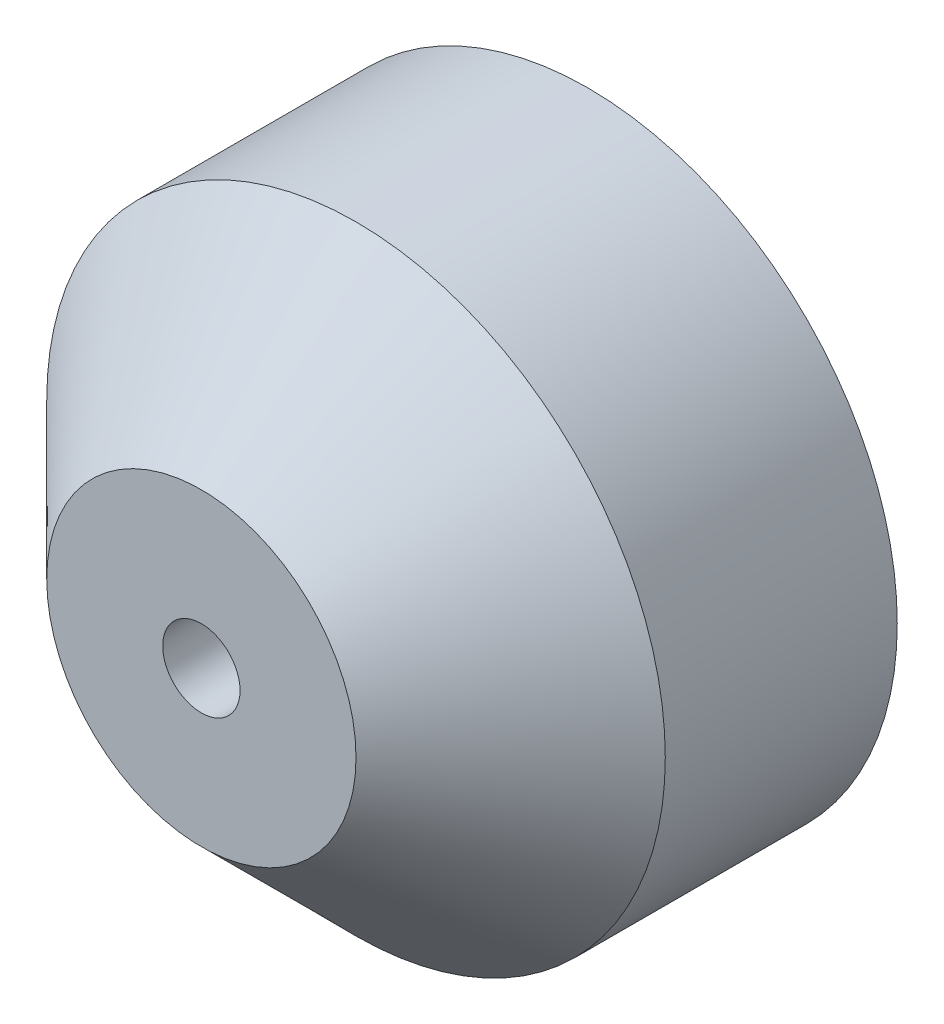
ISO-10303-21;
HEADER;
FILE_DESCRIPTION(('STEP AP214'),'2;1');
FILE_NAME('part.step','',(''),(''),'','','');
FILE_SCHEMA(('AUTOMOTIVE_DESIGN { 1 0 10303 214 1 1 1 1 }'));
ENDSEC;
DATA;
#1=APPLICATION_CONTEXT('core data for automotive mechanical design processes');
#2=APPLICATION_PROTOCOL_DEFINITION('international standard','automotive_design',2000,#1);
#3=PRODUCT_CONTEXT('',#1,'mechanical');
#4=PRODUCT('Part','Part','',(#3));
#5=PRODUCT_RELATED_PRODUCT_CATEGORY('part','',(#4));
#6=PRODUCT_DEFINITION_FORMATION('','',#4);
#7=PRODUCT_DEFINITION_CONTEXT('part definition',#1,'design');
#8=PRODUCT_DEFINITION('design','',#6,#7);
#9=PRODUCT_DEFINITION_SHAPE('','',#8);
#10=(LENGTH_UNIT() NAMED_UNIT(*) SI_UNIT(.MILLI.,.METRE.));
#11=(NAMED_UNIT(*) PLANE_ANGLE_UNIT() SI_UNIT($,.RADIAN.));
#12=(NAMED_UNIT(*) SI_UNIT($,.STERADIAN.) SOLID_ANGLE_UNIT());
#13=UNCERTAINTY_MEASURE_WITH_UNIT(LENGTH_MEASURE(1.E-05),#10,'distance_accuracy_value','');
#14=(GEOMETRIC_REPRESENTATION_CONTEXT(3) GLOBAL_UNCERTAINTY_ASSIGNED_CONTEXT((#13)) GLOBAL_UNIT_ASSIGNED_CONTEXT((#10,
#11,#12)) REPRESENTATION_CONTEXT('',''));
#15=CARTESIAN_POINT('',(0.,0.,0.));
#16=DIRECTION('',(0.,0.,1.));
#17=DIRECTION('',(1.,0.,0.));
#18=AXIS2_PLACEMENT_3D('',#15,#16,#17);
#19=CARTESIAN_POINT('',(0.,0.,25.));
#20=DIRECTION('',(0.,0.,-1.));
#21=DIRECTION('',(-1.,0.,0.));
#22=AXIS2_PLACEMENT_3D('',#19,#20,#21);
#23=CYLINDRICAL_SURFACE('',#22,20.);
#24=CARTESIAN_POINT('',(0.,0.,14.9999999999999));
#25=DIRECTION('',(0.,0.,1.));
#26=DIRECTION('',(1.,0.,0.));
#27=AXIS2_PLACEMENT_3D('',#24,#25,#26);
#28=CIRCLE('',#27,20.);
#29=CARTESIAN_POINT('',(20.,0.,14.9999999999999));
#30=VERTEX_POINT('',#29);
#31=EDGE_CURVE('E39',#30,#30,#28,.F.);
#32=ORIENTED_EDGE('',*,*,#31,.T.);
#33=EDGE_LOOP('',(#32));
#34=FACE_BOUND('',#33,.T.);
#35=CARTESIAN_POINT('',(0.,0.,0.));
#36=DIRECTION('',(0.,0.,1.));
#37=DIRECTION('',(1.,0.,0.));
#38=AXIS2_PLACEMENT_3D('',#35,#36,#37);
#39=CIRCLE('',#38,20.);
#40=CARTESIAN_POINT('',(20.,0.,0.));
#41=VERTEX_POINT('',#40);
#42=EDGE_CURVE('E54',#41,#41,#39,.T.);
#43=ORIENTED_EDGE('',*,*,#42,.T.);
#44=EDGE_LOOP('',(#43));
#45=FACE_BOUND('',#44,.T.);
#46=ADVANCED_FACE('F34',(#34,#45),#23,.T.);
#47=CARTESIAN_POINT('',(0.,0.,25.));
#48=DIRECTION('',(0.,0.,1.));
#49=DIRECTION('',(1.,0.,0.));
#50=AXIS2_PLACEMENT_3D('',#47,#48,#49);
#51=PLANE('',#50);
#52=CARTESIAN_POINT('',(0.,0.,25.));
#53=DIRECTION('',(0.,0.,1.));
#54=DIRECTION('',(1.,0.,0.));
#55=AXIS2_PLACEMENT_3D('',#52,#53,#54);
#56=CIRCLE('',#55,2.5);
#57=CARTESIAN_POINT('',(2.5,0.,25.));
#58=VERTEX_POINT('',#57);
#59=EDGE_CURVE('E55',#58,#58,#56,.T.);
#60=ORIENTED_EDGE('',*,*,#59,.F.);
#61=EDGE_LOOP('',(#60));
#62=FACE_BOUND('',#61,.T.);
#63=CARTESIAN_POINT('',(0.,0.,25.));
#64=DIRECTION('',(0.,0.,1.));
#65=DIRECTION('',(1.,0.,0.));
#66=AXIS2_PLACEMENT_3D('',#63,#64,#65);
#67=CIRCLE('',#66,9.99999999999998);
#68=CARTESIAN_POINT('',(9.99999999999998,0.,25.));
#69=VERTEX_POINT('',#68);
#70=EDGE_CURVE('E47',#69,#69,#67,.T.);
#71=ORIENTED_EDGE('',*,*,#70,.T.);
#72=EDGE_LOOP('',(#71));
#73=FACE_BOUND('',#72,.T.);
#74=ADVANCED_FACE('F62',(#62,#73),#51,.T.);
#75=CARTESIAN_POINT('',(0.,0.,0.));
#76=DIRECTION('',(0.,0.,1.));
#77=DIRECTION('',(1.,0.,0.));
#78=AXIS2_PLACEMENT_3D('',#75,#76,#77);
#79=PLANE('',#78);
#80=CARTESIAN_POINT('',(0.,0.,0.));
#81=DIRECTION('',(0.,0.,-1.));
#82=DIRECTION('',(-1.,0.,0.));
#83=AXIS2_PLACEMENT_3D('',#80,#81,#82);
#84=CIRCLE('',#83,7.5);
#85=CARTESIAN_POINT('',(-7.5,0.,0.));
#86=VERTEX_POINT('',#85);
#87=EDGE_CURVE('E10',#86,#86,#84,.T.);
#88=ORIENTED_EDGE('',*,*,#87,.F.);
#89=EDGE_LOOP('',(#88));
#90=FACE_BOUND('',#89,.T.);
#91=ORIENTED_EDGE('',*,*,#42,.F.);
#92=EDGE_LOOP('',(#91));
#93=FACE_BOUND('',#92,.T.);
#94=ADVANCED_FACE('F66',(#90,#93),#79,.F.);
#95=CARTESIAN_POINT('',(0.,0.,25.));
#96=DIRECTION('',(0.,0.,-1.));
#97=DIRECTION('',(-1.,0.,0.));
#98=AXIS2_PLACEMENT_3D('',#95,#96,#97);
#99=CONICAL_SURFACE('',#98,9.99999999999998,0.785398163397447);
#100=ORIENTED_EDGE('',*,*,#31,.F.);
#101=EDGE_LOOP('',(#100));
#102=FACE_BOUND('',#101,.T.);
#103=ORIENTED_EDGE('',*,*,#70,.F.);
#104=EDGE_LOOP('',(#103));
#105=FACE_BOUND('',#104,.T.);
#106=ADVANCED_FACE('F37',(#102,#105),#99,.T.);
#107=CARTESIAN_POINT('',(0.,0.,10.));
#108=DIRECTION('',(0.,0.,1.));
#109=DIRECTION('',(1.,0.,0.));
#110=AXIS2_PLACEMENT_3D('',#107,#108,#109);
#111=CYLINDRICAL_SURFACE('',#110,2.5);
#112=CARTESIAN_POINT('',(0.,0.,10.));
#113=DIRECTION('',(0.,0.,1.));
#114=DIRECTION('',(1.,0.,0.));
#115=AXIS2_PLACEMENT_3D('',#112,#113,#114);
#116=CIRCLE('',#115,2.5);
#117=CARTESIAN_POINT('',(2.5,0.,10.));
#118=VERTEX_POINT('',#117);
#119=EDGE_CURVE('E51',#118,#118,#116,.T.);
#120=ORIENTED_EDGE('',*,*,#119,.F.);
#121=EDGE_LOOP('',(#120));
#122=FACE_BOUND('',#121,.T.);
#123=ORIENTED_EDGE('',*,*,#59,.T.);
#124=EDGE_LOOP('',(#123));
#125=FACE_BOUND('',#124,.T.);
#126=ADVANCED_FACE('F65',(#122,#125),#111,.F.);
#127=CARTESIAN_POINT('',(0.,0.,10.));
#128=DIRECTION('',(0.,0.,1.));
#129=DIRECTION('',(1.,0.,0.));
#130=AXIS2_PLACEMENT_3D('',#127,#128,#129);
#131=PLANE('',#130);
#132=ORIENTED_EDGE('',*,*,#119,.T.);
#133=EDGE_LOOP('',(#132));
#134=FACE_BOUND('',#133,.T.);
#135=ADVANCED_FACE('F72',(#134),#131,.T.);
#136=CARTESIAN_POINT('',(0.,0.,-7.));
#137=DIRECTION('',(0.,0.,1.));
#138=DIRECTION('',(1.,0.,0.));
#139=AXIS2_PLACEMENT_3D('',#136,#137,#138);
#140=CYLINDRICAL_SURFACE('',#139,7.5);
#141=CARTESIAN_POINT('',(0.,0.,-7.));
#142=DIRECTION('',(0.,0.,-1.));
#143=DIRECTION('',(-1.,0.,0.));
#144=AXIS2_PLACEMENT_3D('',#141,#142,#143);
#145=CIRCLE('',#144,7.5);
#146=CARTESIAN_POINT('',(-7.5,0.,-7.));
#147=VERTEX_POINT('',#146);
#148=EDGE_CURVE('E50',#147,#147,#145,.T.);
#149=ORIENTED_EDGE('',*,*,#148,.F.);
#150=EDGE_LOOP('',(#149));
#151=FACE_BOUND('',#150,.T.);
#152=ORIENTED_EDGE('',*,*,#87,.T.);
#153=EDGE_LOOP('',(#152));
#154=FACE_BOUND('',#153,.T.);
#155=ADVANCED_FACE('F89',(#151,#154),#140,.T.);
#156=CARTESIAN_POINT('',(0.,0.,-7.));
#157=DIRECTION('',(0.,0.,-1.));
#158=DIRECTION('',(-1.,0.,0.));
#159=AXIS2_PLACEMENT_3D('',#156,#157,#158);
#160=PLANE('',#159);
#161=ORIENTED_EDGE('',*,*,#148,.T.);
#162=EDGE_LOOP('',(#161));
#163=FACE_BOUND('',#162,.T.);
#164=ADVANCED_FACE('F93',(#163),#160,.T.);
#165=CLOSED_SHELL('',(#46,#74,#94,#106,#126,#135,#155,#164));
#166=MANIFOLD_SOLID_BREP('B2',#165);
#167=ADVANCED_BREP_SHAPE_REPRESENTATION('',(#18,#166),#14);
#168=SHAPE_DEFINITION_REPRESENTATION(#9,#167);
ENDSEC;
END-ISO-10303-21;
